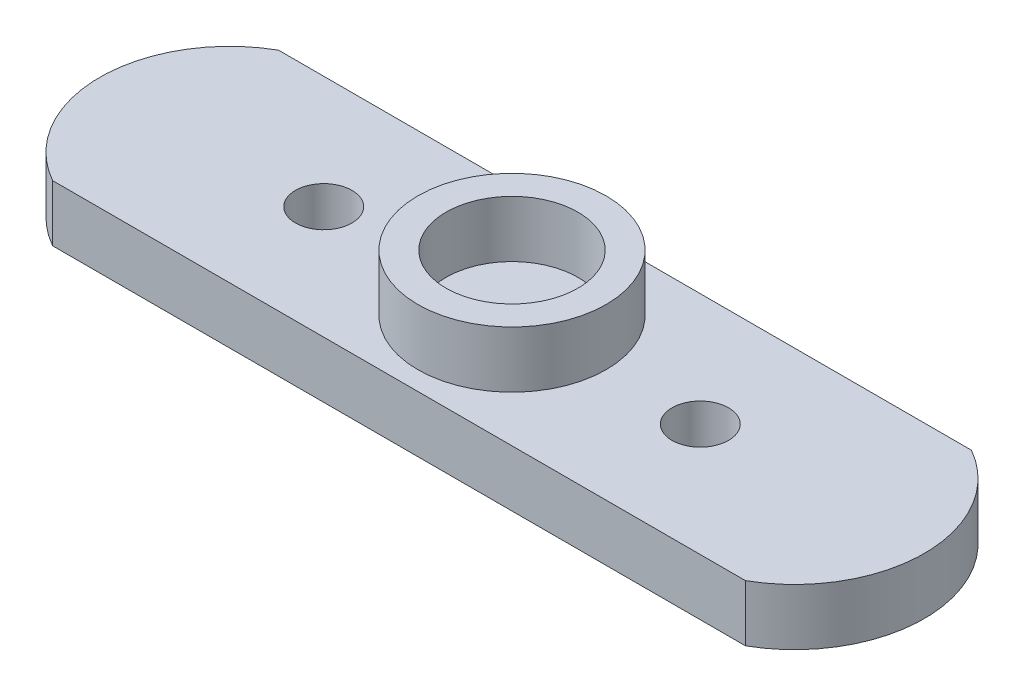
ISO-10303-21;
HEADER;
FILE_DESCRIPTION(('STEP AP214'),'2;1');
FILE_NAME('part.step','',(''),(''),'','','');
FILE_SCHEMA(('AUTOMOTIVE_DESIGN { 1 0 10303 214 1 1 1 1 }'));
ENDSEC;
DATA;
#1=APPLICATION_CONTEXT('core data for automotive mechanical design processes');
#2=APPLICATION_PROTOCOL_DEFINITION('international standard','automotive_design',2000,#1);
#3=PRODUCT_CONTEXT('',#1,'mechanical');
#4=PRODUCT('Part','Part','',(#3));
#5=PRODUCT_RELATED_PRODUCT_CATEGORY('part','',(#4));
#6=PRODUCT_DEFINITION_FORMATION('','',#4);
#7=PRODUCT_DEFINITION_CONTEXT('part definition',#1,'design');
#8=PRODUCT_DEFINITION('design','',#6,#7);
#9=PRODUCT_DEFINITION_SHAPE('','',#8);
#10=(LENGTH_UNIT() NAMED_UNIT(*) SI_UNIT(.MILLI.,.METRE.));
#11=(NAMED_UNIT(*) PLANE_ANGLE_UNIT() SI_UNIT($,.RADIAN.));
#12=(NAMED_UNIT(*) SI_UNIT($,.STERADIAN.) SOLID_ANGLE_UNIT());
#13=UNCERTAINTY_MEASURE_WITH_UNIT(LENGTH_MEASURE(1.E-05),#10,'distance_accuracy_value','');
#14=(GEOMETRIC_REPRESENTATION_CONTEXT(3) GLOBAL_UNCERTAINTY_ASSIGNED_CONTEXT((#13)) GLOBAL_UNIT_ASSIGNED_CONTEXT((#10,
#11,#12)) REPRESENTATION_CONTEXT('',''));
#15=CARTESIAN_POINT('',(0.,0.,0.));
#16=DIRECTION('',(0.,0.,1.));
#17=DIRECTION('',(1.,0.,0.));
#18=AXIS2_PLACEMENT_3D('',#15,#16,#17);
#19=CARTESIAN_POINT('',(-15.0071428571428,3.,0.));
#20=DIRECTION('',(0.,-1.,0.));
#21=DIRECTION('',(0.,0.,-1.));
#22=AXIS2_PLACEMENT_3D('',#19,#20,#21);
#23=PLANE('',#22);
#24=CARTESIAN_POINT('',(0.,3.,0.));
#25=DIRECTION('',(0.,-1.,0.));
#26=DIRECTION('',(0.,0.,-1.));
#27=AXIS2_PLACEMENT_3D('',#24,#25,#26);
#28=CIRCLE('',#27,5.);
#29=CARTESIAN_POINT('',(0.,3.,-5.));
#30=VERTEX_POINT('',#29);
#31=EDGE_CURVE('E11',#30,#30,#28,.F.);
#32=ORIENTED_EDGE('',*,*,#31,.F.);
#33=EDGE_LOOP('',(#32));
#34=FACE_BOUND('',#33,.T.);
#35=CARTESIAN_POINT('',(-15.0071428571428,3.,0.));
#36=DIRECTION('',(0.,1.,0.));
#37=DIRECTION('',(0.,0.,-1.));
#38=AXIS2_PLACEMENT_3D('',#35,#36,#37);
#39=CIRCLE('',#38,6.89285714285715);
#40=CARTESIAN_POINT('',(-18.4,3.,-6.));
#41=VERTEX_POINT('',#40);
#42=CARTESIAN_POINT('',(-18.4,3.,6.));
#43=VERTEX_POINT('',#42);
#44=EDGE_CURVE('E87',#41,#43,#39,.T.);
#45=ORIENTED_EDGE('',*,*,#44,.T.);
#46=DIRECTION('',(1.,0.,0.));
#47=VECTOR('',#46,1.);
#48=CARTESIAN_POINT('',(-18.4,3.,6.));
#49=LINE('',#48,#47);
#50=CARTESIAN_POINT('',(18.4,3.,6.));
#51=VERTEX_POINT('',#50);
#52=EDGE_CURVE('E82',#43,#51,#49,.T.);
#53=ORIENTED_EDGE('',*,*,#52,.T.);
#54=CARTESIAN_POINT('',(15.0071428571429,3.,0.));
#55=DIRECTION('',(0.,1.,0.));
#56=DIRECTION('',(0.,0.,1.));
#57=AXIS2_PLACEMENT_3D('',#54,#55,#56);
#58=CIRCLE('',#57,6.89285714285714);
#59=CARTESIAN_POINT('',(18.4,3.,-6.));
#60=VERTEX_POINT('',#59);
#61=EDGE_CURVE('E85',#51,#60,#58,.T.);
#62=ORIENTED_EDGE('',*,*,#61,.T.);
#63=DIRECTION('',(-1.,0.,0.));
#64=VECTOR('',#63,1.);
#65=CARTESIAN_POINT('',(-18.4,3.,-6.));
#66=LINE('',#65,#64);
#67=EDGE_CURVE('E51',#60,#41,#66,.T.);
#68=ORIENTED_EDGE('',*,*,#67,.T.);
#69=EDGE_LOOP('',(#45,#53,#62,#68));
#70=FACE_BOUND('',#69,.T.);
#71=CARTESIAN_POINT('',(10.,3.,0.));
#72=DIRECTION('',(0.,1.,0.));
#73=DIRECTION('',(0.,0.,1.));
#74=AXIS2_PLACEMENT_3D('',#71,#72,#73);
#75=CIRCLE('',#74,1.5025);
#76=CARTESIAN_POINT('',(10.,3.,1.5025));
#77=VERTEX_POINT('',#76);
#78=EDGE_CURVE('E104',#77,#77,#75,.T.);
#79=ORIENTED_EDGE('',*,*,#78,.F.);
#80=EDGE_LOOP('',(#79));
#81=FACE_BOUND('',#80,.T.);
#82=CARTESIAN_POINT('',(-10.,3.,0.));
#83=DIRECTION('',(0.,1.,0.));
#84=DIRECTION('',(0.,0.,1.));
#85=AXIS2_PLACEMENT_3D('',#82,#83,#84);
#86=CIRCLE('',#85,1.5025);
#87=CARTESIAN_POINT('',(-10.,3.,1.5025));
#88=VERTEX_POINT('',#87);
#89=EDGE_CURVE('E121',#88,#88,#86,.T.);
#90=ORIENTED_EDGE('',*,*,#89,.F.);
#91=EDGE_LOOP('',(#90));
#92=FACE_BOUND('',#91,.T.);
#93=ADVANCED_FACE('F34',(#34,#70,#81,#92),#23,.F.);
#94=CARTESIAN_POINT('',(-15.0071428571428,0.,0.));
#95=DIRECTION('',(0.,-1.,0.));
#96=DIRECTION('',(0.,0.,-1.));
#97=AXIS2_PLACEMENT_3D('',#94,#95,#96);
#98=PLANE('',#97);
#99=CARTESIAN_POINT('',(10.,0.,0.));
#100=DIRECTION('',(0.,1.,0.));
#101=DIRECTION('',(0.,0.,1.));
#102=AXIS2_PLACEMENT_3D('',#99,#100,#101);
#103=CIRCLE('',#102,1.5025);
#104=CARTESIAN_POINT('',(10.,0.,1.5025));
#105=VERTEX_POINT('',#104);
#106=EDGE_CURVE('E125',#105,#105,#103,.T.);
#107=ORIENTED_EDGE('',*,*,#106,.T.);
#108=EDGE_LOOP('',(#107));
#109=FACE_BOUND('',#108,.T.);
#110=CARTESIAN_POINT('',(-15.0071428571428,0.,0.));
#111=DIRECTION('',(0.,1.,0.));
#112=DIRECTION('',(0.,0.,-1.));
#113=AXIS2_PLACEMENT_3D('',#110,#111,#112);
#114=CIRCLE('',#113,6.89285714285715);
#115=CARTESIAN_POINT('',(-18.4,0.,-6.));
#116=VERTEX_POINT('',#115);
#117=CARTESIAN_POINT('',(-18.4,0.,6.));
#118=VERTEX_POINT('',#117);
#119=EDGE_CURVE('E101',#116,#118,#114,.T.);
#120=ORIENTED_EDGE('',*,*,#119,.F.);
#121=DIRECTION('',(-1.,0.,0.));
#122=VECTOR('',#121,1.);
#123=CARTESIAN_POINT('',(-18.4,0.,-6.));
#124=LINE('',#123,#122);
#125=CARTESIAN_POINT('',(18.4,0.,-6.));
#126=VERTEX_POINT('',#125);
#127=EDGE_CURVE('E74',#126,#116,#124,.T.);
#128=ORIENTED_EDGE('',*,*,#127,.F.);
#129=CARTESIAN_POINT('',(15.0071428571429,0.,0.));
#130=DIRECTION('',(0.,1.,0.));
#131=DIRECTION('',(0.,0.,1.));
#132=AXIS2_PLACEMENT_3D('',#129,#130,#131);
#133=CIRCLE('',#132,6.89285714285714);
#134=CARTESIAN_POINT('',(18.4,0.,6.));
#135=VERTEX_POINT('',#134);
#136=EDGE_CURVE('E68',#135,#126,#133,.T.);
#137=ORIENTED_EDGE('',*,*,#136,.F.);
#138=DIRECTION('',(1.,0.,0.));
#139=VECTOR('',#138,1.);
#140=CARTESIAN_POINT('',(-18.4,0.,6.));
#141=LINE('',#140,#139);
#142=EDGE_CURVE('E92',#118,#135,#141,.T.);
#143=ORIENTED_EDGE('',*,*,#142,.F.);
#144=EDGE_LOOP('',(#120,#128,#137,#143));
#145=FACE_BOUND('',#144,.T.);
#146=CARTESIAN_POINT('',(-10.,0.,0.));
#147=DIRECTION('',(0.,1.,0.));
#148=DIRECTION('',(0.,0.,1.));
#149=AXIS2_PLACEMENT_3D('',#146,#147,#148);
#150=CIRCLE('',#149,1.5025);
#151=CARTESIAN_POINT('',(-10.,0.,1.5025));
#152=VERTEX_POINT('',#151);
#153=EDGE_CURVE('E119',#152,#152,#150,.T.);
#154=ORIENTED_EDGE('',*,*,#153,.T.);
#155=EDGE_LOOP('',(#154));
#156=FACE_BOUND('',#155,.T.);
#157=ADVANCED_FACE('F112',(#109,#145,#156),#98,.T.);
#158=CARTESIAN_POINT('',(-15.0071428571428,3.,0.));
#159=DIRECTION('',(0.,-1.,0.));
#160=DIRECTION('',(0.,0.,-1.));
#161=AXIS2_PLACEMENT_3D('',#158,#159,#160);
#162=CYLINDRICAL_SURFACE('',#161,6.89285714285715);
#163=ORIENTED_EDGE('',*,*,#119,.T.);
#164=DIRECTION('',(0.,-1.,0.));
#165=VECTOR('',#164,1.);
#166=CARTESIAN_POINT('',(-18.4,3.,6.));
#167=LINE('',#166,#165);
#168=EDGE_CURVE('E43',#43,#118,#167,.T.);
#169=ORIENTED_EDGE('',*,*,#168,.F.);
#170=ORIENTED_EDGE('',*,*,#44,.F.);
#171=DIRECTION('',(0.,-1.,0.));
#172=VECTOR('',#171,1.);
#173=CARTESIAN_POINT('',(-18.4,3.,-6.));
#174=LINE('',#173,#172);
#175=EDGE_CURVE('E97',#41,#116,#174,.T.);
#176=ORIENTED_EDGE('',*,*,#175,.T.);
#177=EDGE_LOOP('',(#163,#169,#170,#176));
#178=FACE_BOUND('',#177,.T.);
#179=ADVANCED_FACE('F36',(#178),#162,.T.);
#180=CARTESIAN_POINT('',(-18.4,3.,6.));
#181=DIRECTION('',(0.,0.,-1.));
#182=DIRECTION('',(-1.,0.,0.));
#183=AXIS2_PLACEMENT_3D('',#180,#181,#182);
#184=PLANE('',#183);
#185=ORIENTED_EDGE('',*,*,#142,.T.);
#186=DIRECTION('',(0.,-1.,0.));
#187=VECTOR('',#186,1.);
#188=CARTESIAN_POINT('',(18.4,3.,6.));
#189=LINE('',#188,#187);
#190=EDGE_CURVE('E90',#51,#135,#189,.T.);
#191=ORIENTED_EDGE('',*,*,#190,.F.);
#192=ORIENTED_EDGE('',*,*,#52,.F.);
#193=ORIENTED_EDGE('',*,*,#168,.T.);
#194=EDGE_LOOP('',(#185,#191,#192,#193));
#195=FACE_BOUND('',#194,.T.);
#196=ADVANCED_FACE('F91',(#195),#184,.F.);
#197=CARTESIAN_POINT('',(15.0071428571429,3.,0.));
#198=DIRECTION('',(0.,-1.,0.));
#199=DIRECTION('',(0.,0.,-1.));
#200=AXIS2_PLACEMENT_3D('',#197,#198,#199);
#201=CYLINDRICAL_SURFACE('',#200,6.89285714285714);
#202=ORIENTED_EDGE('',*,*,#136,.T.);
#203=DIRECTION('',(0.,-1.,0.));
#204=VECTOR('',#203,1.);
#205=CARTESIAN_POINT('',(18.4,3.,-6.));
#206=LINE('',#205,#204);
#207=EDGE_CURVE('E93',#60,#126,#206,.T.);
#208=ORIENTED_EDGE('',*,*,#207,.F.);
#209=ORIENTED_EDGE('',*,*,#61,.F.);
#210=ORIENTED_EDGE('',*,*,#190,.T.);
#211=EDGE_LOOP('',(#202,#208,#209,#210));
#212=FACE_BOUND('',#211,.T.);
#213=ADVANCED_FACE('F95',(#212),#201,.T.);
#214=CARTESIAN_POINT('',(-18.4,3.,-6.));
#215=DIRECTION('',(0.,0.,1.));
#216=DIRECTION('',(1.,0.,0.));
#217=AXIS2_PLACEMENT_3D('',#214,#215,#216);
#218=PLANE('',#217);
#219=ORIENTED_EDGE('',*,*,#127,.T.);
#220=ORIENTED_EDGE('',*,*,#175,.F.);
#221=ORIENTED_EDGE('',*,*,#67,.F.);
#222=ORIENTED_EDGE('',*,*,#207,.T.);
#223=EDGE_LOOP('',(#219,#220,#221,#222));
#224=FACE_BOUND('',#223,.T.);
#225=ADVANCED_FACE('F139',(#224),#218,.F.);
#226=CARTESIAN_POINT('',(10.,3.,0.));
#227=DIRECTION('',(0.,-1.,0.));
#228=DIRECTION('',(0.,0.,-1.));
#229=AXIS2_PLACEMENT_3D('',#226,#227,#228);
#230=CYLINDRICAL_SURFACE('',#229,1.5025);
#231=ORIENTED_EDGE('',*,*,#78,.T.);
#232=EDGE_LOOP('',(#231));
#233=FACE_BOUND('',#232,.T.);
#234=ORIENTED_EDGE('',*,*,#106,.F.);
#235=EDGE_LOOP('',(#234));
#236=FACE_BOUND('',#235,.T.);
#237=ADVANCED_FACE('F136',(#233,#236),#230,.F.);
#238=CARTESIAN_POINT('',(-10.,3.,0.));
#239=DIRECTION('',(0.,-1.,0.));
#240=DIRECTION('',(0.,0.,-1.));
#241=AXIS2_PLACEMENT_3D('',#238,#239,#240);
#242=CYLINDRICAL_SURFACE('',#241,1.5025);
#243=ORIENTED_EDGE('',*,*,#89,.T.);
#244=EDGE_LOOP('',(#243));
#245=FACE_BOUND('',#244,.T.);
#246=ORIENTED_EDGE('',*,*,#153,.F.);
#247=EDGE_LOOP('',(#246));
#248=FACE_BOUND('',#247,.T.);
#249=ADVANCED_FACE('F138',(#245,#248),#242,.F.);
#250=CARTESIAN_POINT('',(0.,6.,0.));
#251=DIRECTION('',(0.,1.,0.));
#252=DIRECTION('',(0.,0.,1.));
#253=AXIS2_PLACEMENT_3D('',#250,#251,#252);
#254=PLANE('',#253);
#255=CARTESIAN_POINT('',(0.,6.,0.));
#256=DIRECTION('',(0.,1.,0.));
#257=DIRECTION('',(0.,0.,1.));
#258=AXIS2_PLACEMENT_3D('',#255,#256,#257);
#259=CIRCLE('',#258,5.);
#260=CARTESIAN_POINT('',(0.,6.,5.));
#261=VERTEX_POINT('',#260);
#262=EDGE_CURVE('E122',#261,#261,#259,.T.);
#263=ORIENTED_EDGE('',*,*,#262,.T.);
#264=EDGE_LOOP('',(#263));
#265=FACE_BOUND('',#264,.T.);
#266=CARTESIAN_POINT('',(0.,6.,0.));
#267=DIRECTION('',(0.,1.,0.));
#268=DIRECTION('',(0.,0.,1.));
#269=AXIS2_PLACEMENT_3D('',#266,#267,#268);
#270=CIRCLE('',#269,3.5025);
#271=CARTESIAN_POINT('',(0.,6.,3.5025));
#272=VERTEX_POINT('',#271);
#273=EDGE_CURVE('E128',#272,#272,#270,.T.);
#274=ORIENTED_EDGE('',*,*,#273,.F.);
#275=EDGE_LOOP('',(#274));
#276=FACE_BOUND('',#275,.T.);
#277=ADVANCED_FACE('F146',(#265,#276),#254,.T.);
#278=CARTESIAN_POINT('',(0.,6.,0.));
#279=DIRECTION('',(0.,-1.,0.));
#280=DIRECTION('',(0.,0.,-1.));
#281=AXIS2_PLACEMENT_3D('',#278,#279,#280);
#282=CYLINDRICAL_SURFACE('',#281,5.);
#283=ORIENTED_EDGE('',*,*,#262,.F.);
#284=EDGE_LOOP('',(#283));
#285=FACE_BOUND('',#284,.T.);
#286=ORIENTED_EDGE('',*,*,#31,.T.);
#287=EDGE_LOOP('',(#286));
#288=FACE_BOUND('',#287,.T.);
#289=ADVANCED_FACE('F163',(#285,#288),#282,.T.);
#290=CARTESIAN_POINT('',(0.,6.,0.));
#291=DIRECTION('',(0.,-1.,0.));
#292=DIRECTION('',(0.,0.,-1.));
#293=AXIS2_PLACEMENT_3D('',#290,#291,#292);
#294=CYLINDRICAL_SURFACE('',#293,3.5025);
#295=ORIENTED_EDGE('',*,*,#273,.T.);
#296=EDGE_LOOP('',(#295));
#297=FACE_BOUND('',#296,.T.);
#298=CARTESIAN_POINT('',(0.,3.,0.));
#299=DIRECTION('',(0.,1.,0.));
#300=DIRECTION('',(0.,0.,1.));
#301=AXIS2_PLACEMENT_3D('',#298,#299,#300);
#302=CIRCLE('',#301,3.5025);
#303=CARTESIAN_POINT('',(0.,3.,3.5025));
#304=VERTEX_POINT('',#303);
#305=EDGE_CURVE('E168',#304,#304,#302,.T.);
#306=ORIENTED_EDGE('',*,*,#305,.F.);
#307=EDGE_LOOP('',(#306));
#308=FACE_BOUND('',#307,.T.);
#309=ADVANCED_FACE('F158',(#297,#308),#294,.F.);
#310=ORIENTED_EDGE('',*,*,#305,.T.);
#311=EDGE_LOOP('',(#310));
#312=FACE_BOUND('',#311,.T.);
#313=ADVANCED_FACE('F153',(#312),#23,.F.);
#314=CLOSED_SHELL('',(#93,#157,#179,#196,#213,#225,#237,#249,#277,#289,#309,#313));
#315=MANIFOLD_SOLID_BREP('B2',#314);
#316=ADVANCED_BREP_SHAPE_REPRESENTATION('',(#18,#315),#14);
#317=SHAPE_DEFINITION_REPRESENTATION(#9,#316);
ENDSEC;
END-ISO-10303-21;
